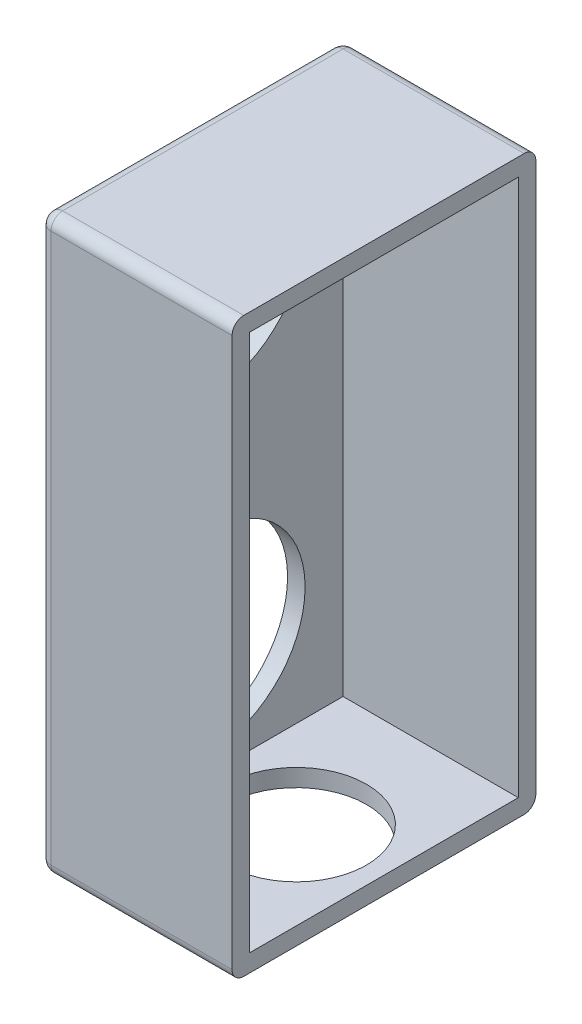
ISO-10303-21;
HEADER;
FILE_DESCRIPTION(('STEP AP214'),'2;1');
FILE_NAME('part.step','',(''),(''),'','','');
FILE_SCHEMA(('AUTOMOTIVE_DESIGN { 1 0 10303 214 1 1 1 1 }'));
ENDSEC;
DATA;
#1=APPLICATION_CONTEXT('core data for automotive mechanical design processes');
#2=APPLICATION_PROTOCOL_DEFINITION('international standard','automotive_design',2000,#1);
#3=PRODUCT_CONTEXT('',#1,'mechanical');
#4=PRODUCT('Part','Part','',(#3));
#5=PRODUCT_RELATED_PRODUCT_CATEGORY('part','',(#4));
#6=PRODUCT_DEFINITION_FORMATION('','',#4);
#7=PRODUCT_DEFINITION_CONTEXT('part definition',#1,'design');
#8=PRODUCT_DEFINITION('design','',#6,#7);
#9=PRODUCT_DEFINITION_SHAPE('','',#8);
#10=(LENGTH_UNIT() NAMED_UNIT(*) SI_UNIT(.MILLI.,.METRE.));
#11=(NAMED_UNIT(*) PLANE_ANGLE_UNIT() SI_UNIT($,.RADIAN.));
#12=(NAMED_UNIT(*) SI_UNIT($,.STERADIAN.) SOLID_ANGLE_UNIT());
#13=UNCERTAINTY_MEASURE_WITH_UNIT(LENGTH_MEASURE(1.E-05),#10,'distance_accuracy_value','');
#14=(GEOMETRIC_REPRESENTATION_CONTEXT(3) GLOBAL_UNCERTAINTY_ASSIGNED_CONTEXT((#13)) GLOBAL_UNIT_ASSIGNED_CONTEXT((#10,
#11,#12)) REPRESENTATION_CONTEXT('',''));
#15=CARTESIAN_POINT('',(0.,0.,0.));
#16=DIRECTION('',(0.,0.,1.));
#17=DIRECTION('',(1.,0.,0.));
#18=AXIS2_PLACEMENT_3D('',#15,#16,#17);
#19=CARTESIAN_POINT('',(7.49999999999999,46.,11.5));
#20=DIRECTION('',(-1.,0.,0.));
#21=DIRECTION('',(0.,0.,1.));
#22=AXIS2_PLACEMENT_3D('',#19,#20,#21);
#23=PLANE('',#22);
#24=DIRECTION('',(0.,-1.,0.));
#25=VECTOR('',#24,1.);
#26=CARTESIAN_POINT('',(7.49999999999999,46.,13.));
#27=LINE('',#26,#25);
#28=CARTESIAN_POINT('',(7.49999999999999,46.5,13.));
#29=VERTEX_POINT('',#28);
#30=CARTESIAN_POINT('',(7.49999999999999,-0.5,13.));
#31=VERTEX_POINT('',#30);
#32=EDGE_CURVE('E174',#29,#31,#27,.T.);
#33=ORIENTED_EDGE('',*,*,#32,.T.);
#34=CARTESIAN_POINT('',(7.49999999999999,-0.5,12.));
#35=DIRECTION('',(-1.,0.,0.));
#36=DIRECTION('',(0.,0.,1.));
#37=AXIS2_PLACEMENT_3D('',#34,#35,#36);
#38=CIRCLE('',#37,1.);
#39=CARTESIAN_POINT('',(7.49999999999999,-1.5,12.));
#40=VERTEX_POINT('',#39);
#41=EDGE_CURVE('E194',#31,#40,#38,.F.);
#42=ORIENTED_EDGE('',*,*,#41,.T.);
#43=DIRECTION('',(0.,0.,-1.));
#44=VECTOR('',#43,1.);
#45=CARTESIAN_POINT('',(7.49999999999999,-1.5,11.5));
#46=LINE('',#45,#44);
#47=CARTESIAN_POINT('',(7.49999999999999,-1.5,-12.));
#48=VERTEX_POINT('',#47);
#49=EDGE_CURVE('E164',#40,#48,#46,.T.);
#50=ORIENTED_EDGE('',*,*,#49,.T.);
#51=CARTESIAN_POINT('',(7.49999999999999,-0.5,-12.));
#52=DIRECTION('',(-1.,0.,0.));
#53=DIRECTION('',(0.,0.,1.));
#54=AXIS2_PLACEMENT_3D('',#51,#52,#53);
#55=CIRCLE('',#54,1.);
#56=CARTESIAN_POINT('',(7.49999999999999,-0.5,-13.));
#57=VERTEX_POINT('',#56);
#58=EDGE_CURVE('E188',#48,#57,#55,.F.);
#59=ORIENTED_EDGE('',*,*,#58,.T.);
#60=DIRECTION('',(0.,-1.,0.));
#61=VECTOR('',#60,1.);
#62=CARTESIAN_POINT('',(7.49999999999999,46.,-13.));
#63=LINE('',#62,#61);
#64=CARTESIAN_POINT('',(7.49999999999999,46.5,-13.));
#65=VERTEX_POINT('',#64);
#66=EDGE_CURVE('E177',#65,#57,#63,.T.);
#67=ORIENTED_EDGE('',*,*,#66,.F.);
#68=CARTESIAN_POINT('',(7.49999999999999,46.5,-12.));
#69=DIRECTION('',(-1.,0.,0.));
#70=DIRECTION('',(0.,0.,1.));
#71=AXIS2_PLACEMENT_3D('',#68,#69,#70);
#72=CIRCLE('',#71,1.);
#73=CARTESIAN_POINT('',(7.49999999999999,47.5,-12.));
#74=VERTEX_POINT('',#73);
#75=EDGE_CURVE('E190',#65,#74,#72,.F.);
#76=ORIENTED_EDGE('',*,*,#75,.T.);
#77=DIRECTION('',(0.,0.,-1.));
#78=VECTOR('',#77,1.);
#79=CARTESIAN_POINT('',(7.49999999999999,47.5,11.5));
#80=LINE('',#79,#78);
#81=CARTESIAN_POINT('',(7.49999999999999,47.5,12.));
#82=VERTEX_POINT('',#81);
#83=EDGE_CURVE('E168',#82,#74,#80,.T.);
#84=ORIENTED_EDGE('',*,*,#83,.F.);
#85=CARTESIAN_POINT('',(7.49999999999999,46.5,12.));
#86=DIRECTION('',(-1.,0.,0.));
#87=DIRECTION('',(0.,0.,1.));
#88=AXIS2_PLACEMENT_3D('',#85,#86,#87);
#89=CIRCLE('',#88,1.);
#90=EDGE_CURVE('E192',#82,#29,#89,.F.);
#91=ORIENTED_EDGE('',*,*,#90,.T.);
#92=EDGE_LOOP('',(#33,#42,#50,#59,#67,#76,#84,#91));
#93=FACE_BOUND('',#92,.T.);
#94=DIRECTION('',(0.,0.,-1.));
#95=VECTOR('',#94,1.);
#96=CARTESIAN_POINT('',(7.49999999999999,0.,11.5));
#97=LINE('',#96,#95);
#98=CARTESIAN_POINT('',(7.49999999999999,0.,11.5));
#99=VERTEX_POINT('',#98);
#100=CARTESIAN_POINT('',(7.49999999999999,0.,-11.5));
#101=VERTEX_POINT('',#100);
#102=EDGE_CURVE('E280',#99,#101,#97,.T.);
#103=ORIENTED_EDGE('',*,*,#102,.F.);
#104=DIRECTION('',(0.,-1.,0.));
#105=VECTOR('',#104,1.);
#106=CARTESIAN_POINT('',(7.49999999999999,46.,11.5));
#107=LINE('',#106,#105);
#108=CARTESIAN_POINT('',(7.49999999999999,46.,11.5));
#109=VERTEX_POINT('',#108);
#110=EDGE_CURVE('E165',#109,#99,#107,.T.);
#111=ORIENTED_EDGE('',*,*,#110,.F.);
#112=DIRECTION('',(0.,0.,-1.));
#113=VECTOR('',#112,1.);
#114=CARTESIAN_POINT('',(7.49999999999999,46.,11.5));
#115=LINE('',#114,#113);
#116=CARTESIAN_POINT('',(7.49999999999999,46.,-11.5));
#117=VERTEX_POINT('',#116);
#118=EDGE_CURVE('E145',#109,#117,#115,.T.);
#119=ORIENTED_EDGE('',*,*,#118,.T.);
#120=DIRECTION('',(0.,-1.,0.));
#121=VECTOR('',#120,1.);
#122=CARTESIAN_POINT('',(7.49999999999999,46.,-11.5));
#123=LINE('',#122,#121);
#124=EDGE_CURVE('E170',#117,#101,#123,.T.);
#125=ORIENTED_EDGE('',*,*,#124,.T.);
#126=EDGE_LOOP('',(#103,#111,#119,#125));
#127=FACE_BOUND('',#126,.T.);
#128=ADVANCED_FACE('F39',(#93,#127),#23,.F.);
#129=CARTESIAN_POINT('',(-9.00000000000001,46.,11.5));
#130=DIRECTION('',(1.,0.,0.));
#131=DIRECTION('',(0.,0.,-1.));
#132=AXIS2_PLACEMENT_3D('',#129,#130,#131);
#133=PLANE('',#132);
#134=DIRECTION('',(0.,0.,1.));
#135=VECTOR('',#134,1.);
#136=CARTESIAN_POINT('',(-9.00000000000001,-0.5,11.5));
#137=LINE('',#136,#135);
#138=CARTESIAN_POINT('',(-9.00000000000001,-0.5,-12.));
#139=VERTEX_POINT('',#138);
#140=CARTESIAN_POINT('',(-9.00000000000001,-0.5,12.));
#141=VERTEX_POINT('',#140);
#142=EDGE_CURVE('E204',#139,#141,#137,.T.);
#143=ORIENTED_EDGE('',*,*,#142,.T.);
#144=DIRECTION('',(0.,-1.,0.));
#145=VECTOR('',#144,1.);
#146=CARTESIAN_POINT('',(-9.00000000000001,46.,12.));
#147=LINE('',#146,#145);
#148=CARTESIAN_POINT('',(-9.00000000000001,46.5,12.));
#149=VERTEX_POINT('',#148);
#150=EDGE_CURVE('E208',#141,#149,#147,.F.);
#151=ORIENTED_EDGE('',*,*,#150,.T.);
#152=DIRECTION('',(0.,0.,1.));
#153=VECTOR('',#152,1.);
#154=CARTESIAN_POINT('',(-9.00000000000001,46.5,-13.));
#155=LINE('',#154,#153);
#156=CARTESIAN_POINT('',(-9.00000000000001,46.5,-12.));
#157=VERTEX_POINT('',#156);
#158=EDGE_CURVE('E206',#149,#157,#155,.F.);
#159=ORIENTED_EDGE('',*,*,#158,.T.);
#160=DIRECTION('',(0.,-1.,0.));
#161=VECTOR('',#160,1.);
#162=CARTESIAN_POINT('',(-9.00000000000001,46.,-12.));
#163=LINE('',#162,#161);
#164=EDGE_CURVE('E202',#157,#139,#163,.T.);
#165=ORIENTED_EDGE('',*,*,#164,.T.);
#166=EDGE_LOOP('',(#143,#151,#159,#165));
#167=FACE_BOUND('',#166,.T.);
#168=CARTESIAN_POINT('',(-9.00000000000001,36.25,0.));
#169=DIRECTION('',(-1.,0.,0.));
#170=DIRECTION('',(0.,0.,1.));
#171=AXIS2_PLACEMENT_3D('',#168,#169,#170);
#172=CIRCLE('',#171,8.25);
#173=CARTESIAN_POINT('',(-9.00000000000001,36.25,8.25));
#174=VERTEX_POINT('',#173);
#175=EDGE_CURVE('E263',#174,#174,#172,.T.);
#176=ORIENTED_EDGE('',*,*,#175,.F.);
#177=EDGE_LOOP('',(#176));
#178=FACE_BOUND('',#177,.T.);
#179=CARTESIAN_POINT('',(-9.00000000000001,9.74999999999999,0.));
#180=DIRECTION('',(-1.,0.,0.));
#181=DIRECTION('',(0.,0.,-1.));
#182=AXIS2_PLACEMENT_3D('',#179,#180,#181);
#183=CIRCLE('',#182,8.25);
#184=CARTESIAN_POINT('',(-9.00000000000001,9.74999999999999,-8.24999999999999));
#185=VERTEX_POINT('',#184);
#186=EDGE_CURVE('E258',#185,#185,#183,.T.);
#187=ORIENTED_EDGE('',*,*,#186,.F.);
#188=EDGE_LOOP('',(#187));
#189=FACE_BOUND('',#188,.T.);
#190=ADVANCED_FACE('F305',(#167,#178,#189),#133,.F.);
#191=CARTESIAN_POINT('',(7.49999999999999,46.,13.));
#192=DIRECTION('',(0.,0.,-1.));
#193=DIRECTION('',(-1.,0.,0.));
#194=AXIS2_PLACEMENT_3D('',#191,#192,#193);
#195=PLANE('',#194);
#196=DIRECTION('',(0.,-1.,0.));
#197=VECTOR('',#196,1.);
#198=CARTESIAN_POINT('',(-8.,46.,13.));
#199=LINE('',#198,#197);
#200=CARTESIAN_POINT('',(-8.,46.5,13.));
#201=VERTEX_POINT('',#200);
#202=CARTESIAN_POINT('',(-8.,-0.5,13.));
#203=VERTEX_POINT('',#202);
#204=EDGE_CURVE('E183',#201,#203,#199,.T.);
#205=ORIENTED_EDGE('',*,*,#204,.T.);
#206=DIRECTION('',(1.,0.,0.));
#207=VECTOR('',#206,1.);
#208=CARTESIAN_POINT('',(7.49999999999999,-0.5,13.));
#209=LINE('',#208,#207);
#210=EDGE_CURVE('E185',#203,#31,#209,.T.);
#211=ORIENTED_EDGE('',*,*,#210,.T.);
#212=ORIENTED_EDGE('',*,*,#32,.F.);
#213=DIRECTION('',(1.,0.,0.));
#214=VECTOR('',#213,1.);
#215=CARTESIAN_POINT('',(-9.00000000000001,46.5,13.));
#216=LINE('',#215,#214);
#217=EDGE_CURVE('E176',#29,#201,#216,.F.);
#218=ORIENTED_EDGE('',*,*,#217,.T.);
#219=EDGE_LOOP('',(#205,#211,#212,#218));
#220=FACE_BOUND('',#219,.T.);
#221=ADVANCED_FACE('F311',(#220),#195,.F.);
#222=CARTESIAN_POINT('',(7.49999999999999,46.,-13.));
#223=DIRECTION('',(0.,0.,1.));
#224=DIRECTION('',(1.,0.,0.));
#225=AXIS2_PLACEMENT_3D('',#222,#223,#224);
#226=PLANE('',#225);
#227=DIRECTION('',(0.,-1.,0.));
#228=VECTOR('',#227,1.);
#229=CARTESIAN_POINT('',(-8.,46.,-13.));
#230=LINE('',#229,#228);
#231=CARTESIAN_POINT('',(-8.,-0.5,-13.));
#232=VERTEX_POINT('',#231);
#233=CARTESIAN_POINT('',(-8.,46.5,-13.));
#234=VERTEX_POINT('',#233);
#235=EDGE_CURVE('E55',#232,#234,#230,.F.);
#236=ORIENTED_EDGE('',*,*,#235,.T.);
#237=DIRECTION('',(-1.,0.,0.));
#238=VECTOR('',#237,1.);
#239=CARTESIAN_POINT('',(7.49999999999999,46.5,-13.));
#240=LINE('',#239,#238);
#241=EDGE_CURVE('E11',#234,#65,#240,.F.);
#242=ORIENTED_EDGE('',*,*,#241,.T.);
#243=ORIENTED_EDGE('',*,*,#66,.T.);
#244=DIRECTION('',(-1.,0.,0.));
#245=VECTOR('',#244,1.);
#246=CARTESIAN_POINT('',(7.49999999999999,-0.5,-13.));
#247=LINE('',#246,#245);
#248=EDGE_CURVE('E48',#57,#232,#247,.T.);
#249=ORIENTED_EDGE('',*,*,#248,.T.);
#250=EDGE_LOOP('',(#236,#242,#243,#249));
#251=FACE_BOUND('',#250,.T.);
#252=ADVANCED_FACE('F319',(#251),#226,.F.);
#253=CARTESIAN_POINT('',(0.,47.5,0.));
#254=DIRECTION('',(0.,1.,0.));
#255=DIRECTION('',(0.,0.,1.));
#256=AXIS2_PLACEMENT_3D('',#253,#254,#255);
#257=PLANE('',#256);
#258=DIRECTION('',(0.,0.,1.));
#259=VECTOR('',#258,1.);
#260=CARTESIAN_POINT('',(-8.,47.5,13.));
#261=LINE('',#260,#259);
#262=CARTESIAN_POINT('',(-8.,47.5,-12.));
#263=VERTEX_POINT('',#262);
#264=CARTESIAN_POINT('',(-8.,47.5,12.));
#265=VERTEX_POINT('',#264);
#266=EDGE_CURVE('E213',#263,#265,#261,.T.);
#267=ORIENTED_EDGE('',*,*,#266,.T.);
#268=DIRECTION('',(1.,0.,0.));
#269=VECTOR('',#268,1.);
#270=CARTESIAN_POINT('',(7.49999999999999,47.5,12.));
#271=LINE('',#270,#269);
#272=EDGE_CURVE('E215',#265,#82,#271,.T.);
#273=ORIENTED_EDGE('',*,*,#272,.T.);
#274=ORIENTED_EDGE('',*,*,#83,.T.);
#275=DIRECTION('',(-1.,0.,0.));
#276=VECTOR('',#275,1.);
#277=CARTESIAN_POINT('',(-9.00000000000001,47.5,-12.));
#278=LINE('',#277,#276);
#279=EDGE_CURVE('E211',#74,#263,#278,.T.);
#280=ORIENTED_EDGE('',*,*,#279,.T.);
#281=EDGE_LOOP('',(#267,#273,#274,#280));
#282=FACE_BOUND('',#281,.T.);
#283=ADVANCED_FACE('F323',(#282),#257,.T.);
#284=CARTESIAN_POINT('',(0.,-1.5,0.));
#285=DIRECTION('',(0.,1.,0.));
#286=DIRECTION('',(0.,0.,1.));
#287=AXIS2_PLACEMENT_3D('',#284,#285,#286);
#288=PLANE('',#287);
#289=CARTESIAN_POINT('',(0.,-1.5,0.));
#290=DIRECTION('',(0.,-1.,0.));
#291=DIRECTION('',(0.,0.,-1.));
#292=AXIS2_PLACEMENT_3D('',#289,#290,#291);
#293=CIRCLE('',#292,6.);
#294=CARTESIAN_POINT('',(0.,-1.5,-6.));
#295=VERTEX_POINT('',#294);
#296=EDGE_CURVE('E267',#295,#295,#293,.T.);
#297=ORIENTED_EDGE('',*,*,#296,.F.);
#298=EDGE_LOOP('',(#297));
#299=FACE_BOUND('',#298,.T.);
#300=ORIENTED_EDGE('',*,*,#49,.F.);
#301=DIRECTION('',(1.,0.,0.));
#302=VECTOR('',#301,1.);
#303=CARTESIAN_POINT('',(0.,-1.5,12.));
#304=LINE('',#303,#302);
#305=CARTESIAN_POINT('',(-8.,-1.5,12.));
#306=VERTEX_POINT('',#305);
#307=EDGE_CURVE('E200',#40,#306,#304,.F.);
#308=ORIENTED_EDGE('',*,*,#307,.T.);
#309=DIRECTION('',(0.,0.,1.));
#310=VECTOR('',#309,1.);
#311=CARTESIAN_POINT('',(-8.,-1.5,0.));
#312=LINE('',#311,#310);
#313=CARTESIAN_POINT('',(-8.,-1.5,-12.));
#314=VERTEX_POINT('',#313);
#315=EDGE_CURVE('E198',#306,#314,#312,.F.);
#316=ORIENTED_EDGE('',*,*,#315,.T.);
#317=DIRECTION('',(-1.,0.,0.));
#318=VECTOR('',#317,1.);
#319=CARTESIAN_POINT('',(0.,-1.5,-12.));
#320=LINE('',#319,#318);
#321=EDGE_CURVE('E196',#314,#48,#320,.F.);
#322=ORIENTED_EDGE('',*,*,#321,.T.);
#323=EDGE_LOOP('',(#300,#308,#316,#322));
#324=FACE_BOUND('',#323,.T.);
#325=ADVANCED_FACE('F326',(#299,#324),#288,.F.);
#326=CARTESIAN_POINT('',(-7.50000000000001,46.,11.5));
#327=DIRECTION('',(1.,0.,0.));
#328=DIRECTION('',(0.,0.,-1.));
#329=AXIS2_PLACEMENT_3D('',#326,#327,#328);
#330=PLANE('',#329);
#331=CARTESIAN_POINT('',(-7.50000000000001,36.25,0.));
#332=DIRECTION('',(-1.,0.,0.));
#333=DIRECTION('',(0.,0.,1.));
#334=AXIS2_PLACEMENT_3D('',#331,#332,#333);
#335=CIRCLE('',#334,8.25);
#336=CARTESIAN_POINT('',(-7.50000000000001,36.25,8.25));
#337=VERTEX_POINT('',#336);
#338=EDGE_CURVE('E273',#337,#337,#335,.T.);
#339=ORIENTED_EDGE('',*,*,#338,.T.);
#340=EDGE_LOOP('',(#339));
#341=FACE_BOUND('',#340,.T.);
#342=CARTESIAN_POINT('',(-7.50000000000001,9.74999999999999,0.));
#343=DIRECTION('',(-1.,0.,0.));
#344=DIRECTION('',(0.,0.,-1.));
#345=AXIS2_PLACEMENT_3D('',#342,#343,#344);
#346=CIRCLE('',#345,8.25);
#347=CARTESIAN_POINT('',(-7.50000000000001,9.74999999999999,-8.24999999999999));
#348=VERTEX_POINT('',#347);
#349=EDGE_CURVE('E253',#348,#348,#346,.T.);
#350=ORIENTED_EDGE('',*,*,#349,.T.);
#351=EDGE_LOOP('',(#350));
#352=FACE_BOUND('',#351,.T.);
#353=DIRECTION('',(0.,0.,1.));
#354=VECTOR('',#353,1.);
#355=CARTESIAN_POINT('',(-7.50000000000001,0.,11.5));
#356=LINE('',#355,#354);
#357=CARTESIAN_POINT('',(-7.50000000000001,0.,-11.5));
#358=VERTEX_POINT('',#357);
#359=CARTESIAN_POINT('',(-7.50000000000001,0.,11.5));
#360=VERTEX_POINT('',#359);
#361=EDGE_CURVE('E270',#358,#360,#356,.T.);
#362=ORIENTED_EDGE('',*,*,#361,.F.);
#363=DIRECTION('',(0.,-1.,0.));
#364=VECTOR('',#363,1.);
#365=CARTESIAN_POINT('',(-7.50000000000001,46.,-11.5));
#366=LINE('',#365,#364);
#367=CARTESIAN_POINT('',(-7.50000000000001,46.,-11.5));
#368=VERTEX_POINT('',#367);
#369=EDGE_CURVE('E159',#368,#358,#366,.T.);
#370=ORIENTED_EDGE('',*,*,#369,.F.);
#371=DIRECTION('',(0.,0.,1.));
#372=VECTOR('',#371,1.);
#373=CARTESIAN_POINT('',(-7.50000000000001,46.,11.5));
#374=LINE('',#373,#372);
#375=CARTESIAN_POINT('',(-7.50000000000001,46.,11.5));
#376=VERTEX_POINT('',#375);
#377=EDGE_CURVE('E143',#368,#376,#374,.T.);
#378=ORIENTED_EDGE('',*,*,#377,.T.);
#379=DIRECTION('',(0.,-1.,0.));
#380=VECTOR('',#379,1.);
#381=CARTESIAN_POINT('',(-7.50000000000001,46.,11.5));
#382=LINE('',#381,#380);
#383=EDGE_CURVE('E156',#376,#360,#382,.T.);
#384=ORIENTED_EDGE('',*,*,#383,.T.);
#385=EDGE_LOOP('',(#362,#370,#378,#384));
#386=FACE_BOUND('',#385,.T.);
#387=ADVANCED_FACE('F155',(#341,#352,#386),#330,.T.);
#388=CARTESIAN_POINT('',(7.49999999999999,46.,11.5));
#389=DIRECTION('',(0.,0.,-1.));
#390=DIRECTION('',(-1.,0.,0.));
#391=AXIS2_PLACEMENT_3D('',#388,#389,#390);
#392=PLANE('',#391);
#393=DIRECTION('',(1.,0.,0.));
#394=VECTOR('',#393,1.);
#395=CARTESIAN_POINT('',(7.49999999999999,0.,11.5));
#396=LINE('',#395,#394);
#397=EDGE_CURVE('E163',#360,#99,#396,.T.);
#398=ORIENTED_EDGE('',*,*,#397,.F.);
#399=ORIENTED_EDGE('',*,*,#383,.F.);
#400=DIRECTION('',(1.,0.,0.));
#401=VECTOR('',#400,1.);
#402=CARTESIAN_POINT('',(7.49999999999999,46.,11.5));
#403=LINE('',#402,#401);
#404=EDGE_CURVE('E139',#376,#109,#403,.T.);
#405=ORIENTED_EDGE('',*,*,#404,.T.);
#406=ORIENTED_EDGE('',*,*,#110,.T.);
#407=EDGE_LOOP('',(#398,#399,#405,#406));
#408=FACE_BOUND('',#407,.T.);
#409=ADVANCED_FACE('F162',(#408),#392,.T.);
#410=CARTESIAN_POINT('',(7.49999999999999,46.,-11.5));
#411=DIRECTION('',(0.,0.,1.));
#412=DIRECTION('',(1.,0.,0.));
#413=AXIS2_PLACEMENT_3D('',#410,#411,#412);
#414=PLANE('',#413);
#415=DIRECTION('',(-1.,0.,0.));
#416=VECTOR('',#415,1.);
#417=CARTESIAN_POINT('',(7.49999999999999,0.,-11.5));
#418=LINE('',#417,#416);
#419=EDGE_CURVE('E160',#101,#358,#418,.T.);
#420=ORIENTED_EDGE('',*,*,#419,.F.);
#421=ORIENTED_EDGE('',*,*,#124,.F.);
#422=DIRECTION('',(-1.,0.,0.));
#423=VECTOR('',#422,1.);
#424=CARTESIAN_POINT('',(7.49999999999999,46.,-11.5));
#425=LINE('',#424,#423);
#426=EDGE_CURVE('E276',#117,#368,#425,.T.);
#427=ORIENTED_EDGE('',*,*,#426,.T.);
#428=ORIENTED_EDGE('',*,*,#369,.T.);
#429=EDGE_LOOP('',(#420,#421,#427,#428));
#430=FACE_BOUND('',#429,.T.);
#431=ADVANCED_FACE('F288',(#430),#414,.T.);
#432=CARTESIAN_POINT('',(0.,46.,0.));
#433=DIRECTION('',(0.,1.,0.));
#434=DIRECTION('',(0.,0.,1.));
#435=AXIS2_PLACEMENT_3D('',#432,#433,#434);
#436=PLANE('',#435);
#437=ORIENTED_EDGE('',*,*,#377,.F.);
#438=ORIENTED_EDGE('',*,*,#426,.F.);
#439=ORIENTED_EDGE('',*,*,#118,.F.);
#440=ORIENTED_EDGE('',*,*,#404,.F.);
#441=EDGE_LOOP('',(#437,#438,#439,#440));
#442=FACE_BOUND('',#441,.T.);
#443=ADVANCED_FACE('F141',(#442),#436,.F.);
#444=CARTESIAN_POINT('',(0.,0.,0.));
#445=DIRECTION('',(0.,1.,0.));
#446=DIRECTION('',(0.,0.,1.));
#447=AXIS2_PLACEMENT_3D('',#444,#445,#446);
#448=PLANE('',#447);
#449=CARTESIAN_POINT('',(0.,0.,0.));
#450=DIRECTION('',(0.,-1.,0.));
#451=DIRECTION('',(0.,0.,-1.));
#452=AXIS2_PLACEMENT_3D('',#449,#450,#451);
#453=CIRCLE('',#452,6.);
#454=CARTESIAN_POINT('',(0.,0.,-6.));
#455=VERTEX_POINT('',#454);
#456=EDGE_CURVE('E271',#455,#455,#453,.T.);
#457=ORIENTED_EDGE('',*,*,#456,.T.);
#458=EDGE_LOOP('',(#457));
#459=FACE_BOUND('',#458,.T.);
#460=ORIENTED_EDGE('',*,*,#361,.T.);
#461=ORIENTED_EDGE('',*,*,#397,.T.);
#462=ORIENTED_EDGE('',*,*,#102,.T.);
#463=ORIENTED_EDGE('',*,*,#419,.T.);
#464=EDGE_LOOP('',(#460,#461,#462,#463));
#465=FACE_BOUND('',#464,.T.);
#466=ADVANCED_FACE('F290',(#459,#465),#448,.T.);
#467=CARTESIAN_POINT('',(0.,-1.5,0.));
#468=DIRECTION('',(0.,1.,0.));
#469=DIRECTION('',(0.,0.,1.));
#470=AXIS2_PLACEMENT_3D('',#467,#468,#469);
#471=CYLINDRICAL_SURFACE('',#470,6.);
#472=ORIENTED_EDGE('',*,*,#296,.T.);
#473=EDGE_LOOP('',(#472));
#474=FACE_BOUND('',#473,.T.);
#475=ORIENTED_EDGE('',*,*,#456,.F.);
#476=EDGE_LOOP('',(#475));
#477=FACE_BOUND('',#476,.T.);
#478=ADVANCED_FACE('F292',(#474,#477),#471,.F.);
#479=CARTESIAN_POINT('',(-7.50000000000001,9.74999999999999,0.));
#480=DIRECTION('',(-1.,0.,0.));
#481=DIRECTION('',(0.,0.,1.));
#482=AXIS2_PLACEMENT_3D('',#479,#480,#481);
#483=CYLINDRICAL_SURFACE('',#482,8.25);
#484=ORIENTED_EDGE('',*,*,#349,.F.);
#485=EDGE_LOOP('',(#484));
#486=FACE_BOUND('',#485,.T.);
#487=ORIENTED_EDGE('',*,*,#186,.T.);
#488=EDGE_LOOP('',(#487));
#489=FACE_BOUND('',#488,.T.);
#490=ADVANCED_FACE('F299',(#486,#489),#483,.F.);
#491=CARTESIAN_POINT('',(-7.50000000000001,36.25,0.));
#492=DIRECTION('',(-1.,0.,0.));
#493=DIRECTION('',(0.,0.,1.));
#494=AXIS2_PLACEMENT_3D('',#491,#492,#493);
#495=CYLINDRICAL_SURFACE('',#494,8.25);
#496=ORIENTED_EDGE('',*,*,#338,.F.);
#497=EDGE_LOOP('',(#496));
#498=FACE_BOUND('',#497,.T.);
#499=ORIENTED_EDGE('',*,*,#175,.T.);
#500=EDGE_LOOP('',(#499));
#501=FACE_BOUND('',#500,.T.);
#502=ADVANCED_FACE('F374',(#498,#501),#495,.F.);
#503=CARTESIAN_POINT('',(0.,46.5,-12.));
#504=DIRECTION('',(1.,0.,0.));
#505=DIRECTION('',(0.,0.,-1.));
#506=AXIS2_PLACEMENT_3D('',#503,#504,#505);
#507=CYLINDRICAL_SURFACE('',#506,1.);
#508=CARTESIAN_POINT('',(-8.,46.5,-12.));
#509=DIRECTION('',(-1.,0.,0.));
#510=DIRECTION('',(0.,0.,1.));
#511=AXIS2_PLACEMENT_3D('',#508,#509,#510);
#512=CIRCLE('',#511,1.);
#513=EDGE_CURVE('E43',#263,#234,#512,.T.);
#514=ORIENTED_EDGE('',*,*,#513,.F.);
#515=ORIENTED_EDGE('',*,*,#279,.F.);
#516=ORIENTED_EDGE('',*,*,#75,.F.);
#517=ORIENTED_EDGE('',*,*,#241,.F.);
#518=EDGE_LOOP('',(#514,#515,#516,#517));
#519=FACE_BOUND('',#518,.T.);
#520=ADVANCED_FACE('F41',(#519),#507,.T.);
#521=CARTESIAN_POINT('',(-8.,46.5,-12.));
#522=DIRECTION('',(0.,0.,-1.));
#523=DIRECTION('',(-1.,0.,0.));
#524=AXIS2_PLACEMENT_3D('',#521,#522,#523);
#525=SPHERICAL_SURFACE('',#524,1.);
#526=CARTESIAN_POINT('',(-8.,46.5,-12.));
#527=DIRECTION('',(0.,0.,-1.));
#528=DIRECTION('',(-1.,0.,0.));
#529=AXIS2_PLACEMENT_3D('',#526,#527,#528);
#530=CIRCLE('',#529,1.);
#531=EDGE_CURVE('E245',#263,#157,#530,.F.);
#532=ORIENTED_EDGE('',*,*,#531,.F.);
#533=ORIENTED_EDGE('',*,*,#513,.T.);
#534=CARTESIAN_POINT('',(-8.,46.5,-12.));
#535=DIRECTION('',(0.,1.,0.));
#536=DIRECTION('',(0.,0.,1.));
#537=AXIS2_PLACEMENT_3D('',#534,#535,#536);
#538=CIRCLE('',#537,1.);
#539=EDGE_CURVE('E247',#157,#234,#538,.F.);
#540=ORIENTED_EDGE('',*,*,#539,.F.);
#541=EDGE_LOOP('',(#532,#533,#540));
#542=FACE_BOUND('',#541,.T.);
#543=ADVANCED_FACE('F368',(#542),#525,.T.);
#544=CARTESIAN_POINT('',(7.49999999999999,-0.5,-12.));
#545=DIRECTION('',(-1.,0.,0.));
#546=DIRECTION('',(0.,0.,1.));
#547=AXIS2_PLACEMENT_3D('',#544,#545,#546);
#548=CYLINDRICAL_SURFACE('',#547,1.);
#549=ORIENTED_EDGE('',*,*,#58,.F.);
#550=ORIENTED_EDGE('',*,*,#321,.F.);
#551=CARTESIAN_POINT('',(-8.,-0.5,-12.));
#552=DIRECTION('',(-1.,0.,0.));
#553=DIRECTION('',(0.,0.,1.));
#554=AXIS2_PLACEMENT_3D('',#551,#552,#553);
#555=CIRCLE('',#554,1.);
#556=EDGE_CURVE('E242',#232,#314,#555,.T.);
#557=ORIENTED_EDGE('',*,*,#556,.F.);
#558=ORIENTED_EDGE('',*,*,#248,.F.);
#559=EDGE_LOOP('',(#549,#550,#557,#558));
#560=FACE_BOUND('',#559,.T.);
#561=ADVANCED_FACE('F366',(#560),#548,.T.);
#562=CARTESIAN_POINT('',(-8.,46.,-12.));
#563=DIRECTION('',(0.,-1.,0.));
#564=DIRECTION('',(0.,0.,-1.));
#565=AXIS2_PLACEMENT_3D('',#562,#563,#564);
#566=CYLINDRICAL_SURFACE('',#565,1.);
#567=ORIENTED_EDGE('',*,*,#539,.T.);
#568=ORIENTED_EDGE('',*,*,#235,.F.);
#569=CARTESIAN_POINT('',(-8.,-0.5,-12.));
#570=DIRECTION('',(0.,-1.,0.));
#571=DIRECTION('',(0.,0.,-1.));
#572=AXIS2_PLACEMENT_3D('',#569,#570,#571);
#573=CIRCLE('',#572,1.);
#574=EDGE_CURVE('E239',#139,#232,#573,.T.);
#575=ORIENTED_EDGE('',*,*,#574,.F.);
#576=ORIENTED_EDGE('',*,*,#164,.F.);
#577=EDGE_LOOP('',(#567,#568,#575,#576));
#578=FACE_BOUND('',#577,.T.);
#579=ADVANCED_FACE('F362',(#578),#566,.T.);
#580=CARTESIAN_POINT('',(-8.,46.5,0.));
#581=DIRECTION('',(0.,0.,-1.));
#582=DIRECTION('',(-1.,0.,0.));
#583=AXIS2_PLACEMENT_3D('',#580,#581,#582);
#584=CYLINDRICAL_SURFACE('',#583,1.);
#585=ORIENTED_EDGE('',*,*,#531,.T.);
#586=ORIENTED_EDGE('',*,*,#158,.F.);
#587=CARTESIAN_POINT('',(-8.,46.5,12.));
#588=DIRECTION('',(0.,0.,1.));
#589=DIRECTION('',(1.,0.,0.));
#590=AXIS2_PLACEMENT_3D('',#587,#588,#589);
#591=CIRCLE('',#590,1.);
#592=EDGE_CURVE('E236',#265,#149,#591,.T.);
#593=ORIENTED_EDGE('',*,*,#592,.F.);
#594=ORIENTED_EDGE('',*,*,#266,.F.);
#595=EDGE_LOOP('',(#585,#586,#593,#594));
#596=FACE_BOUND('',#595,.T.);
#597=ADVANCED_FACE('F358',(#596),#584,.T.);
#598=CARTESIAN_POINT('',(0.,46.5,12.));
#599=DIRECTION('',(-1.,0.,0.));
#600=DIRECTION('',(0.,0.,1.));
#601=AXIS2_PLACEMENT_3D('',#598,#599,#600);
#602=CYLINDRICAL_SURFACE('',#601,1.);
#603=ORIENTED_EDGE('',*,*,#90,.F.);
#604=ORIENTED_EDGE('',*,*,#272,.F.);
#605=CARTESIAN_POINT('',(-8.,46.5,12.));
#606=DIRECTION('',(-1.,0.,0.));
#607=DIRECTION('',(0.,0.,1.));
#608=AXIS2_PLACEMENT_3D('',#605,#606,#607);
#609=CIRCLE('',#608,1.);
#610=EDGE_CURVE('E233',#201,#265,#609,.T.);
#611=ORIENTED_EDGE('',*,*,#610,.F.);
#612=ORIENTED_EDGE('',*,*,#217,.F.);
#613=EDGE_LOOP('',(#603,#604,#611,#612));
#614=FACE_BOUND('',#613,.T.);
#615=ADVANCED_FACE('F354',(#614),#602,.T.);
#616=CARTESIAN_POINT('',(-8.,-0.5,-12.));
#617=DIRECTION('',(0.,0.,-1.));
#618=DIRECTION('',(0.,1.,0.));
#619=AXIS2_PLACEMENT_3D('',#616,#617,#618);
#620=SPHERICAL_SURFACE('',#619,1.);
#621=ORIENTED_EDGE('',*,*,#574,.T.);
#622=ORIENTED_EDGE('',*,*,#556,.T.);
#623=CARTESIAN_POINT('',(-8.,-0.5,-12.));
#624=DIRECTION('',(0.,0.,-1.));
#625=DIRECTION('',(-1.,0.,0.));
#626=AXIS2_PLACEMENT_3D('',#623,#624,#625);
#627=CIRCLE('',#626,1.);
#628=EDGE_CURVE('E230',#139,#314,#627,.F.);
#629=ORIENTED_EDGE('',*,*,#628,.F.);
#630=EDGE_LOOP('',(#621,#622,#629));
#631=FACE_BOUND('',#630,.T.);
#632=ADVANCED_FACE('F350',(#631),#620,.T.);
#633=CARTESIAN_POINT('',(-8.,46.5,12.));
#634=DIRECTION('',(0.,1.,0.));
#635=DIRECTION('',(0.,0.,1.));
#636=AXIS2_PLACEMENT_3D('',#633,#634,#635);
#637=SPHERICAL_SURFACE('',#636,1.);
#638=ORIENTED_EDGE('',*,*,#610,.T.);
#639=ORIENTED_EDGE('',*,*,#592,.T.);
#640=CARTESIAN_POINT('',(-8.,46.5,12.));
#641=DIRECTION('',(0.,1.,0.));
#642=DIRECTION('',(0.,0.,1.));
#643=AXIS2_PLACEMENT_3D('',#640,#641,#642);
#644=CIRCLE('',#643,1.);
#645=EDGE_CURVE('E228',#201,#149,#644,.F.);
#646=ORIENTED_EDGE('',*,*,#645,.F.);
#647=EDGE_LOOP('',(#638,#639,#646));
#648=FACE_BOUND('',#647,.T.);
#649=ADVANCED_FACE('F346',(#648),#637,.T.);
#650=CARTESIAN_POINT('',(-8.,-0.5,11.5));
#651=DIRECTION('',(0.,0.,1.));
#652=DIRECTION('',(1.,0.,0.));
#653=AXIS2_PLACEMENT_3D('',#650,#651,#652);
#654=CYLINDRICAL_SURFACE('',#653,1.);
#655=ORIENTED_EDGE('',*,*,#628,.T.);
#656=ORIENTED_EDGE('',*,*,#315,.F.);
#657=CARTESIAN_POINT('',(-8.,-0.5,12.));
#658=DIRECTION('',(0.,0.,1.));
#659=DIRECTION('',(1.,0.,0.));
#660=AXIS2_PLACEMENT_3D('',#657,#658,#659);
#661=CIRCLE('',#660,1.);
#662=EDGE_CURVE('E225',#141,#306,#661,.T.);
#663=ORIENTED_EDGE('',*,*,#662,.F.);
#664=ORIENTED_EDGE('',*,*,#142,.F.);
#665=EDGE_LOOP('',(#655,#656,#663,#664));
#666=FACE_BOUND('',#665,.T.);
#667=ADVANCED_FACE('F342',(#666),#654,.T.);
#668=CARTESIAN_POINT('',(-8.,46.,12.));
#669=DIRECTION('',(0.,-1.,0.));
#670=DIRECTION('',(0.,0.,-1.));
#671=AXIS2_PLACEMENT_3D('',#668,#669,#670);
#672=CYLINDRICAL_SURFACE('',#671,1.);
#673=ORIENTED_EDGE('',*,*,#645,.T.);
#674=ORIENTED_EDGE('',*,*,#150,.F.);
#675=CARTESIAN_POINT('',(-8.,-0.5,12.));
#676=DIRECTION('',(0.,-1.,0.));
#677=DIRECTION('',(0.,0.,-1.));
#678=AXIS2_PLACEMENT_3D('',#675,#676,#677);
#679=CIRCLE('',#678,1.);
#680=EDGE_CURVE('E222',#203,#141,#679,.T.);
#681=ORIENTED_EDGE('',*,*,#680,.F.);
#682=ORIENTED_EDGE('',*,*,#204,.F.);
#683=EDGE_LOOP('',(#673,#674,#681,#682));
#684=FACE_BOUND('',#683,.T.);
#685=ADVANCED_FACE('F338',(#684),#672,.T.);
#686=CARTESIAN_POINT('',(-8.,-0.5,12.));
#687=DIRECTION('',(-1.,0.,0.));
#688=DIRECTION('',(0.,-1.,0.));
#689=AXIS2_PLACEMENT_3D('',#686,#687,#688);
#690=SPHERICAL_SURFACE('',#689,1.);
#691=ORIENTED_EDGE('',*,*,#680,.T.);
#692=ORIENTED_EDGE('',*,*,#662,.T.);
#693=CARTESIAN_POINT('',(-8.,-0.5,12.));
#694=DIRECTION('',(-1.,0.,0.));
#695=DIRECTION('',(0.,0.,1.));
#696=AXIS2_PLACEMENT_3D('',#693,#694,#695);
#697=CIRCLE('',#696,1.);
#698=EDGE_CURVE('E219',#203,#306,#697,.F.);
#699=ORIENTED_EDGE('',*,*,#698,.F.);
#700=EDGE_LOOP('',(#691,#692,#699));
#701=FACE_BOUND('',#700,.T.);
#702=ADVANCED_FACE('F334',(#701),#690,.T.);
#703=CARTESIAN_POINT('',(7.49999999999999,-0.5,12.));
#704=DIRECTION('',(1.,0.,0.));
#705=DIRECTION('',(0.,0.,-1.));
#706=AXIS2_PLACEMENT_3D('',#703,#704,#705);
#707=CYLINDRICAL_SURFACE('',#706,1.);
#708=ORIENTED_EDGE('',*,*,#698,.T.);
#709=ORIENTED_EDGE('',*,*,#307,.F.);
#710=ORIENTED_EDGE('',*,*,#41,.F.);
#711=ORIENTED_EDGE('',*,*,#210,.F.);
#712=EDGE_LOOP('',(#708,#709,#710,#711));
#713=FACE_BOUND('',#712,.T.);
#714=ADVANCED_FACE('F331',(#713),#707,.T.);
#715=CLOSED_SHELL('',(#128,#190,#221,#252,#283,#325,#387,#409,#431,#443,#466,#478,#490,#502,
#520,#543,#561,#579,#597,#615,#632,#649,#667,#685,#702,#714));
#716=MANIFOLD_SOLID_BREP('B2',#715);
#717=ADVANCED_BREP_SHAPE_REPRESENTATION('',(#18,#716),#14);
#718=SHAPE_DEFINITION_REPRESENTATION(#9,#717);
ENDSEC;
END-ISO-10303-21;
